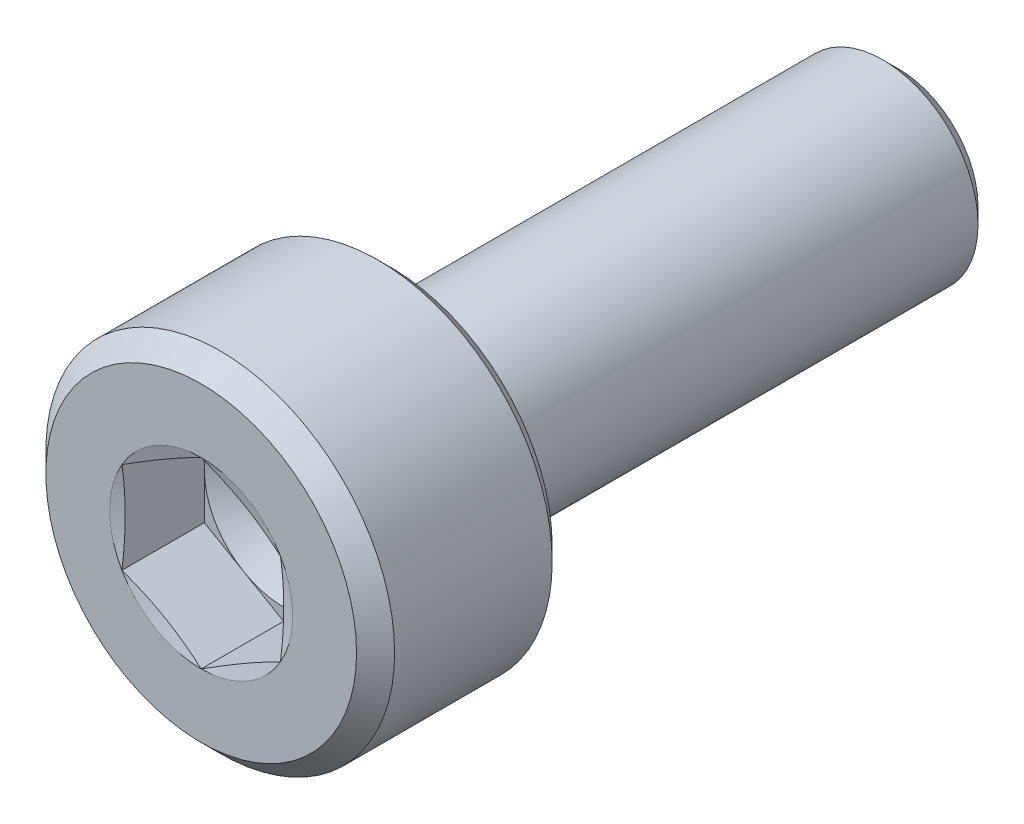
ISO-10303-21;
HEADER;
FILE_DESCRIPTION(('STEP AP214'),'2;1');
FILE_NAME('part.step','',(''),(''),'','','');
FILE_SCHEMA(('AUTOMOTIVE_DESIGN { 1 0 10303 214 1 1 1 1 }'));
ENDSEC;
DATA;
#1=APPLICATION_CONTEXT('core data for automotive mechanical design processes');
#2=APPLICATION_PROTOCOL_DEFINITION('international standard','automotive_design',2000,#1);
#3=PRODUCT_CONTEXT('',#1,'mechanical');
#4=PRODUCT('Part','Part','',(#3));
#5=PRODUCT_RELATED_PRODUCT_CATEGORY('part','',(#4));
#6=PRODUCT_DEFINITION_FORMATION('','',#4);
#7=PRODUCT_DEFINITION_CONTEXT('part definition',#1,'design');
#8=PRODUCT_DEFINITION('design','',#6,#7);
#9=PRODUCT_DEFINITION_SHAPE('','',#8);
#10=(LENGTH_UNIT() NAMED_UNIT(*) SI_UNIT(.MILLI.,.METRE.));
#11=(NAMED_UNIT(*) PLANE_ANGLE_UNIT() SI_UNIT($,.RADIAN.));
#12=(NAMED_UNIT(*) SI_UNIT($,.STERADIAN.) SOLID_ANGLE_UNIT());
#13=UNCERTAINTY_MEASURE_WITH_UNIT(LENGTH_MEASURE(1.E-05),#10,'distance_accuracy_value','');
#14=(GEOMETRIC_REPRESENTATION_CONTEXT(3) GLOBAL_UNCERTAINTY_ASSIGNED_CONTEXT((#13)) GLOBAL_UNIT_ASSIGNED_CONTEXT((#10,
#11,#12)) REPRESENTATION_CONTEXT('',''));
#15=CARTESIAN_POINT('',(0.,0.,0.));
#16=DIRECTION('',(0.,0.,1.));
#17=DIRECTION('',(1.,0.,0.));
#18=AXIS2_PLACEMENT_3D('',#15,#16,#17);
#19=CARTESIAN_POINT('',(0.,0.,0.));
#20=DIRECTION('',(0.,0.,-1.));
#21=DIRECTION('',(-1.,0.,0.));
#22=AXIS2_PLACEMENT_3D('',#19,#20,#21);
#23=PLANE('',#22);
#24=CARTESIAN_POINT('',(0.,0.,0.));
#25=DIRECTION('',(0.,0.,1.));
#26=DIRECTION('',(1.,0.,0.));
#27=AXIS2_PLACEMENT_3D('',#24,#25,#26);
#28=CIRCLE('',#27,2.44999999999999);
#29=CARTESIAN_POINT('',(2.44999999999999,0.,0.));
#30=VERTEX_POINT('',#29);
#31=EDGE_CURVE('E229',#30,#30,#28,.T.);
#32=ORIENTED_EDGE('',*,*,#31,.T.);
#33=EDGE_LOOP('',(#32));
#34=FACE_BOUND('',#33,.T.);
#35=CARTESIAN_POINT('',(0.,0.,0.));
#36=DIRECTION('',(0.,0.,1.));
#37=DIRECTION('',(1.,0.,0.));
#38=AXIS2_PLACEMENT_3D('',#35,#36,#37);
#39=CIRCLE('',#38,1.44337567297407);
#40=CARTESIAN_POINT('',(-1.25,-0.721687836487033,0.));
#41=VERTEX_POINT('',#40);
#42=CARTESIAN_POINT('',(0.,-1.44337567297407,0.));
#43=VERTEX_POINT('',#42);
#44=EDGE_CURVE('E155',#41,#43,#39,.T.);
#45=ORIENTED_EDGE('',*,*,#44,.F.);
#46=CARTESIAN_POINT('',(-1.25,0.721687836487033,0.));
#47=VERTEX_POINT('',#46);
#48=EDGE_CURVE('E154',#47,#41,#39,.T.);
#49=ORIENTED_EDGE('',*,*,#48,.F.);
#50=CARTESIAN_POINT('',(0.,1.44337567297407,0.));
#51=VERTEX_POINT('',#50);
#52=EDGE_CURVE('E121',#51,#47,#39,.T.);
#53=ORIENTED_EDGE('',*,*,#52,.F.);
#54=CARTESIAN_POINT('',(1.25,0.721687836487034,0.));
#55=VERTEX_POINT('',#54);
#56=EDGE_CURVE('E115',#55,#51,#39,.T.);
#57=ORIENTED_EDGE('',*,*,#56,.F.);
#58=CARTESIAN_POINT('',(1.25,-0.721687836487031,0.));
#59=VERTEX_POINT('',#58);
#60=EDGE_CURVE('E123',#59,#55,#39,.T.);
#61=ORIENTED_EDGE('',*,*,#60,.F.);
#62=EDGE_CURVE('E313',#43,#59,#39,.T.);
#63=ORIENTED_EDGE('',*,*,#62,.F.);
#64=EDGE_LOOP('',(#45,#49,#53,#57,#61,#63));
#65=FACE_BOUND('',#64,.T.);
#66=ADVANCED_FACE('F38',(#34,#65),#23,.F.);
#67=CARTESIAN_POINT('',(0.,0.,-0.3));
#68=DIRECTION('',(0.,0.,-1.));
#69=DIRECTION('',(-1.,0.,0.));
#70=AXIS2_PLACEMENT_3D('',#67,#68,#69);
#71=CONICAL_SURFACE('',#70,2.75,0.78539816339746);
#72=ORIENTED_EDGE('',*,*,#31,.F.);
#73=EDGE_LOOP('',(#72));
#74=FACE_BOUND('',#73,.T.);
#75=CARTESIAN_POINT('',(0.,0.,-0.3));
#76=DIRECTION('',(0.,0.,1.));
#77=DIRECTION('',(1.,0.,0.));
#78=AXIS2_PLACEMENT_3D('',#75,#76,#77);
#79=CIRCLE('',#78,2.75);
#80=CARTESIAN_POINT('',(2.75,0.,-0.3));
#81=VERTEX_POINT('',#80);
#82=EDGE_CURVE('E231',#81,#81,#79,.T.);
#83=ORIENTED_EDGE('',*,*,#82,.T.);
#84=EDGE_LOOP('',(#83));
#85=FACE_BOUND('',#84,.T.);
#86=ADVANCED_FACE('F220',(#74,#85),#71,.T.);
#87=CARTESIAN_POINT('',(0.,0.,0.));
#88=DIRECTION('',(0.,0.,1.));
#89=DIRECTION('',(1.,0.,0.));
#90=AXIS2_PLACEMENT_3D('',#87,#88,#89);
#91=CYLINDRICAL_SURFACE('',#90,2.75);
#92=ORIENTED_EDGE('',*,*,#82,.F.);
#93=EDGE_LOOP('',(#92));
#94=FACE_BOUND('',#93,.T.);
#95=CARTESIAN_POINT('',(0.,0.,-2.785));
#96=DIRECTION('',(0.,0.,1.));
#97=DIRECTION('',(1.,0.,0.));
#98=AXIS2_PLACEMENT_3D('',#95,#96,#97);
#99=CIRCLE('',#98,2.75);
#100=CARTESIAN_POINT('',(2.75,0.,-2.785));
#101=VERTEX_POINT('',#100);
#102=EDGE_CURVE('E234',#101,#101,#99,.T.);
#103=ORIENTED_EDGE('',*,*,#102,.T.);
#104=EDGE_LOOP('',(#103));
#105=FACE_BOUND('',#104,.T.);
#106=ADVANCED_FACE('F225',(#94,#105),#91,.T.);
#107=CARTESIAN_POINT('',(0.,0.,-3.));
#108=DIRECTION('',(0.,0.,1.));
#109=DIRECTION('',(1.,0.,0.));
#110=AXIS2_PLACEMENT_3D('',#107,#108,#109);
#111=CONICAL_SURFACE('',#110,2.535,0.785398163397449);
#112=ORIENTED_EDGE('',*,*,#102,.F.);
#113=EDGE_LOOP('',(#112));
#114=FACE_BOUND('',#113,.T.);
#115=CARTESIAN_POINT('',(0.,0.,-3.));
#116=DIRECTION('',(0.,0.,1.));
#117=DIRECTION('',(1.,0.,0.));
#118=AXIS2_PLACEMENT_3D('',#115,#116,#117);
#119=CIRCLE('',#118,2.535);
#120=CARTESIAN_POINT('',(2.535,0.,-3.));
#121=VERTEX_POINT('',#120);
#122=EDGE_CURVE('E239',#121,#121,#119,.T.);
#123=ORIENTED_EDGE('',*,*,#122,.T.);
#124=EDGE_LOOP('',(#123));
#125=FACE_BOUND('',#124,.T.);
#126=ADVANCED_FACE('F429',(#114,#125),#111,.T.);
#127=CARTESIAN_POINT('',(0.,2.535,-3.));
#128=DIRECTION('',(0.,0.,1.));
#129=DIRECTION('',(1.,0.,0.));
#130=AXIS2_PLACEMENT_3D('',#127,#128,#129);
#131=PLANE('',#130);
#132=ORIENTED_EDGE('',*,*,#122,.F.);
#133=EDGE_LOOP('',(#132));
#134=FACE_BOUND('',#133,.T.);
#135=CARTESIAN_POINT('',(0.,0.,-3.));
#136=DIRECTION('',(0.,0.,1.));
#137=DIRECTION('',(1.,0.,0.));
#138=AXIS2_PLACEMENT_3D('',#135,#136,#137);
#139=CIRCLE('',#138,1.8);
#140=CARTESIAN_POINT('',(1.8,0.,-3.));
#141=VERTEX_POINT('',#140);
#142=EDGE_CURVE('E242',#141,#141,#139,.T.);
#143=ORIENTED_EDGE('',*,*,#142,.T.);
#144=EDGE_LOOP('',(#143));
#145=FACE_BOUND('',#144,.T.);
#146=ADVANCED_FACE('F421',(#134,#145),#131,.F.);
#147=CARTESIAN_POINT('',(0.,0.,-3.1));
#148=DIRECTION('',(0.,0.,1.));
#149=DIRECTION('',(1.,0.,0.));
#150=AXIS2_PLACEMENT_3D('',#147,#148,#149);
#151=TOROIDAL_SURFACE('',#150,1.8,0.1);
#152=ORIENTED_EDGE('',*,*,#142,.F.);
#153=EDGE_LOOP('',(#152));
#154=FACE_BOUND('',#153,.T.);
#155=CARTESIAN_POINT('',(0.,0.,-3.05615763679786));
#156=DIRECTION('',(0.,0.,1.));
#157=DIRECTION('',(1.,0.,0.));
#158=AXIS2_PLACEMENT_3D('',#155,#156,#157);
#159=CIRCLE('',#158,1.71012315543561);
#160=CARTESIAN_POINT('',(1.71012315543561,0.,-3.05615763679786));
#161=VERTEX_POINT('',#160);
#162=EDGE_CURVE('E245',#161,#161,#159,.T.);
#163=ORIENTED_EDGE('',*,*,#162,.T.);
#164=EDGE_LOOP('',(#163));
#165=FACE_BOUND('',#164,.T.);
#166=ADVANCED_FACE('F413',(#154,#165),#151,.F.);
#167=CARTESIAN_POINT('',(0.,0.,-3.46615763679786));
#168=DIRECTION('',(0.,0.,1.));
#169=DIRECTION('',(1.,0.,0.));
#170=AXIS2_PLACEMENT_3D('',#167,#168,#169);
#171=CONICAL_SURFACE('',#170,1.51012315543561,0.453844001521511);
#172=ORIENTED_EDGE('',*,*,#162,.F.);
#173=EDGE_LOOP('',(#172));
#174=FACE_BOUND('',#173,.T.);
#175=CARTESIAN_POINT('',(0.,0.,-3.46615763679786));
#176=DIRECTION('',(0.,0.,1.));
#177=DIRECTION('',(1.,0.,0.));
#178=AXIS2_PLACEMENT_3D('',#175,#176,#177);
#179=CIRCLE('',#178,1.51012315543561);
#180=CARTESIAN_POINT('',(1.51012315543561,0.,-3.46615763679786));
#181=VERTEX_POINT('',#180);
#182=EDGE_CURVE('E248',#181,#181,#179,.T.);
#183=ORIENTED_EDGE('',*,*,#182,.T.);
#184=EDGE_LOOP('',(#183));
#185=FACE_BOUND('',#184,.T.);
#186=ADVANCED_FACE('F405',(#174,#185),#171,.T.);
#187=CARTESIAN_POINT('',(0.,0.,-3.51));
#188=DIRECTION('',(0.,0.,1.));
#189=DIRECTION('',(1.,0.,0.));
#190=AXIS2_PLACEMENT_3D('',#187,#188,#189);
#191=TOROIDAL_SURFACE('',#190,1.6,0.1);
#192=ORIENTED_EDGE('',*,*,#182,.F.);
#193=EDGE_LOOP('',(#192));
#194=FACE_BOUND('',#193,.T.);
#195=CARTESIAN_POINT('',(0.,0.,-3.51));
#196=DIRECTION('',(0.,0.,1.));
#197=DIRECTION('',(1.,0.,0.));
#198=AXIS2_PLACEMENT_3D('',#195,#196,#197);
#199=CIRCLE('',#198,1.5);
#200=CARTESIAN_POINT('',(1.5,0.,-3.51));
#201=VERTEX_POINT('',#200);
#202=EDGE_CURVE('E251',#201,#201,#199,.T.);
#203=ORIENTED_EDGE('',*,*,#202,.T.);
#204=EDGE_LOOP('',(#203));
#205=FACE_BOUND('',#204,.T.);
#206=ADVANCED_FACE('F397',(#194,#205),#191,.F.);
#207=CARTESIAN_POINT('',(0.,0.,0.));
#208=DIRECTION('',(0.,0.,1.));
#209=DIRECTION('',(1.,0.,0.));
#210=AXIS2_PLACEMENT_3D('',#207,#208,#209);
#211=CYLINDRICAL_SURFACE('',#210,1.5);
#212=ORIENTED_EDGE('',*,*,#202,.F.);
#213=EDGE_LOOP('',(#212));
#214=FACE_BOUND('',#213,.T.);
#215=CARTESIAN_POINT('',(0.,0.,-10.75));
#216=DIRECTION('',(0.,0.,1.));
#217=DIRECTION('',(1.,0.,0.));
#218=AXIS2_PLACEMENT_3D('',#215,#216,#217);
#219=CIRCLE('',#218,1.5);
#220=CARTESIAN_POINT('',(1.5,0.,-10.75));
#221=VERTEX_POINT('',#220);
#222=EDGE_CURVE('E254',#221,#221,#219,.T.);
#223=ORIENTED_EDGE('',*,*,#222,.T.);
#224=EDGE_LOOP('',(#223));
#225=FACE_BOUND('',#224,.T.);
#226=ADVANCED_FACE('F388',(#214,#225),#211,.T.);
#227=CARTESIAN_POINT('',(0.,0.,-11.));
#228=DIRECTION('',(0.,0.,1.));
#229=DIRECTION('',(1.,0.,0.));
#230=AXIS2_PLACEMENT_3D('',#227,#228,#229);
#231=CONICAL_SURFACE('',#230,1.25,0.785398163397438);
#232=ORIENTED_EDGE('',*,*,#222,.F.);
#233=EDGE_LOOP('',(#232));
#234=FACE_BOUND('',#233,.T.);
#235=CARTESIAN_POINT('',(0.,0.,-11.));
#236=DIRECTION('',(0.,0.,1.));
#237=DIRECTION('',(1.,0.,0.));
#238=AXIS2_PLACEMENT_3D('',#235,#236,#237);
#239=CIRCLE('',#238,1.25);
#240=CARTESIAN_POINT('',(1.25,0.,-11.));
#241=VERTEX_POINT('',#240);
#242=EDGE_CURVE('E257',#241,#241,#239,.T.);
#243=ORIENTED_EDGE('',*,*,#242,.T.);
#244=EDGE_LOOP('',(#243));
#245=FACE_BOUND('',#244,.T.);
#246=ADVANCED_FACE('F380',(#234,#245),#231,.T.);
#247=CARTESIAN_POINT('',(0.,1.25,-11.));
#248=DIRECTION('',(0.,0.,1.));
#249=DIRECTION('',(1.,0.,0.));
#250=AXIS2_PLACEMENT_3D('',#247,#248,#249);
#251=PLANE('',#250);
#252=ORIENTED_EDGE('',*,*,#242,.F.);
#253=EDGE_LOOP('',(#252));
#254=FACE_BOUND('',#253,.T.);
#255=ADVANCED_FACE('F374',(#254),#251,.F.);
#256=CARTESIAN_POINT('',(0.,0.,-0.0518148554092243));
#257=DIRECTION('',(0.,0.,1.));
#258=DIRECTION('',(1.,0.,0.));
#259=AXIS2_PLACEMENT_3D('',#256,#257,#258);
#260=CONICAL_SURFACE('',#259,1.25,1.30899693899575);
#261=ORIENTED_EDGE('',*,*,#52,.T.);
#262=CARTESIAN_POINT('',(-1.2502,0.721572366433195,3.09438201916871E-05));
#263=CARTESIAN_POINT('',(-1.19827409383526,0.751551802335321,-0.00800698378926622));
#264=CARTESIAN_POINT('',(-1.14625401362102,0.781585609650283,-0.0153042105125454));
#265=CARTESIAN_POINT('',(-1.04203006351459,0.841759335300235,-0.0281248924452036));
#266=CARTESIAN_POINT('',(-0.989826127596593,0.871899291755248,-0.0336476265269101));
#267=CARTESIAN_POINT('',(-0.88555111655682,0.932102497448812,-0.0425967858491088));
#268=CARTESIAN_POINT('',(-0.833480747184869,0.962165339222511,-0.0460338877791617));
#269=CARTESIAN_POINT('',(-0.729273575326724,1.0223293779463,-0.0506427032068));
#270=CARTESIAN_POINT('',(-0.677136787663362,1.05243056633842,-0.0518148554092241));
#271=CARTESIAN_POINT('',(-0.572863212336638,1.11263294312267,-0.0518148554092241));
#272=CARTESIAN_POINT('',(-0.520726424673275,1.1427341315148,-0.0506427032068001));
#273=CARTESIAN_POINT('',(-0.416519252815131,1.20289817023859,-0.0460338877791617));
#274=CARTESIAN_POINT('',(-0.36444888344318,1.23296101201229,-0.0425967858491088));
#275=CARTESIAN_POINT('',(-0.260173872403407,1.29316421770585,-0.03364762652691));
#276=CARTESIAN_POINT('',(-0.207969936485411,1.32330417416086,-0.0281248924452036));
#277=CARTESIAN_POINT('',(-0.103745986378985,1.38347789981082,-0.0153042105125453));
#278=CARTESIAN_POINT('',(-0.0517259061647358,1.41351170712578,-0.00800698378926612));
#279=CARTESIAN_POINT('',(0.00020000000000038,1.4434911430279,3.09438201918299E-05));
#280=B_SPLINE_CURVE_WITH_KNOTS('',3,(#262,#263,#264,#265,#266,#267,#268,#269,#270,#271,#272,
#273,#274,#275,#276,#277,#278,#279),.UNSPECIFIED.,.F.,.F.,(4,2,2,2,2,2,2,2,4),(0.,
0.18149525192516,0.363064167833313,0.543695584294992,0.724292010212745,0.9048884361305,
1.08551985259218,1.26708876850033,1.44858402042549),.UNSPECIFIED.);
#281=EDGE_CURVE('E11',#47,#51,#280,.T.);
#282=ORIENTED_EDGE('',*,*,#281,.T.);
#283=EDGE_LOOP('',(#261,#282));
#284=FACE_BOUND('',#283,.T.);
#285=ADVANCED_FACE('F127',(#284),#260,.F.);
#286=CARTESIAN_POINT('',(-1.25,-1.90803764372689,0.224449375411132));
#287=CARTESIAN_POINT('',(-1.25,-1.8513410457493,0.21174373926854));
#288=CARTESIAN_POINT('',(-1.25,-1.79460907964503,0.199195804458375));
#289=CARTESIAN_POINT('',(-1.25,-1.68105673477474,0.174495010900465));
#290=CARTESIAN_POINT('',(-1.25,-1.62423635229394,0.162342169249333));
#291=CARTESIAN_POINT('',(-1.25,-1.4535135757121,0.126574423752231));
#292=CARTESIAN_POINT('',(-1.25,-1.33945900339908,0.103675151182616));
#293=CARTESIAN_POINT('',(-1.25,-1.11170727260793,0.0609587630346281));
#294=CARTESIAN_POINT('',(-1.25,-0.998014548362105,0.0411184667683871));
#295=CARTESIAN_POINT('',(-1.25,-0.769948454688276,0.00583266905587686));
#296=CARTESIAN_POINT('',(-1.25,-0.655575207287998,-0.00961359741797872));
#297=CARTESIAN_POINT('',(-1.25,-0.424787181644499,-0.0341426384914952));
#298=CARTESIAN_POINT('',(-1.25,-0.308363938645654,-0.0431515305449703));
#299=CARTESIAN_POINT('',(-1.25,-0.133499226938177,-0.0502674214127566));
#300=CARTESIAN_POINT('',(-1.25,-0.0751823293286765,-0.0515734559811251));
#301=CARTESIAN_POINT('',(-1.25,0.0414593912908041,-0.0519953132862497));
#302=CARTESIAN_POINT('',(-1.25,0.0997842142946219,-0.0511111377164467));
#303=CARTESIAN_POINT('',(-1.25,0.275064939261687,-0.0452058780708578));
#304=CARTESIAN_POINT('',(-1.25,0.391917619612776,-0.0369155048717787));
#305=CARTESIAN_POINT('',(-1.25,0.624955711707257,-0.013420604100275));
#306=CARTESIAN_POINT('',(-1.25,0.741140574853819,0.00178895996036897));
#307=CARTESIAN_POINT('',(-1.25,0.965009686747211,0.0357098573203466));
#308=CARTESIAN_POINT('',(-1.25,1.07274149713457,0.0541179629895213));
#309=CARTESIAN_POINT('',(-1.25,1.28770836040789,0.0936619087242774));
#310=CARTESIAN_POINT('',(-1.25,1.39494334881407,0.114798093117207));
#311=CARTESIAN_POINT('',(-1.25,1.60905523406172,0.158897571848756));
#312=CARTESIAN_POINT('',(-1.25,1.71593205434096,0.181861233731142));
#313=CARTESIAN_POINT('',(-1.25,1.92941059122614,0.229035853527515));
#314=CARTESIAN_POINT('',(-1.25,2.0360123020935,0.253246837242345));
#315=CARTESIAN_POINT('',(-1.25,2.24796149236902,0.302300913060499));
#316=CARTESIAN_POINT('',(-1.25,2.35331096915779,0.32713541151495));
#317=CARTESIAN_POINT('',(-1.25,2.56386296226419,0.377426560036597));
#318=CARTESIAN_POINT('',(-1.25,2.66906547587909,0.402883221390532));
#319=CARTESIAN_POINT('',(-1.25,2.87922866754162,0.454224569867166));
#320=CARTESIAN_POINT('',(-1.25,2.98418948388924,0.4801086920956));
#321=CARTESIAN_POINT('',(-1.25,3.19401964928918,0.53223064686748));
#322=CARTESIAN_POINT('',(-1.25,3.29888900123911,0.558468467737611));
#323=CARTESIAN_POINT('',(-1.25,3.40372646605654,0.5848316076134));
#324=B_SPLINE_CURVE_WITH_KNOTS('',3,(#286,#287,#288,#289,#290,#291,#292,#293,#294,#295,#296,
#297,#298,#299,#300,#301,#302,#303,#304,#305,#306,#307,#308,#309,#310,#311,#312,#313,#314,#315,
#316,#317,#318,#319,#320,#321,#322,#323),.UNSPECIFIED.,.F.,.F.,(4,2,2,2,2,2,2,2,2,2,2,2,2,2,2,2,
2,2,4),(0.,0.17430798332962,0.348623499364559,0.697591208701206,1.04376859165833,
1.38988566606611,1.73991400543005,1.91487041156219,2.08982668242046,2.44096537417444,
2.79236007022679,3.12019018011378,3.44806170796195,3.77599934506425,4.10394376827983,
4.4286525086615,4.75336714400545,5.07768244044904,5.40198705941089),.UNSPECIFIED.);
#325=EDGE_CURVE('E120',#41,#47,#324,.T.);
#326=ORIENTED_EDGE('',*,*,#325,.T.);
#327=ORIENTED_EDGE('',*,*,#48,.T.);
#328=EDGE_LOOP('',(#326,#327));
#329=FACE_BOUND('',#328,.T.);
#330=ADVANCED_FACE('F361',(#329),#260,.F.);
#331=CARTESIAN_POINT('',(0.000199999999999765,-1.4434911430279,3.09438201913897E-05));
#332=CARTESIAN_POINT('',(-0.0517259061647364,-1.41351170712578,-0.0080069837892665));
#333=CARTESIAN_POINT('',(-0.103745986378985,-1.38347789981081,-0.0153042105125457));
#334=CARTESIAN_POINT('',(-0.207969936485412,-1.32330417416086,-0.028124892445204));
#335=CARTESIAN_POINT('',(-0.260173872403408,-1.29316421770585,-0.0336476265269104));
#336=CARTESIAN_POINT('',(-0.36444888344318,-1.23296101201229,-0.0425967858491091));
#337=CARTESIAN_POINT('',(-0.416519252815131,-1.20289817023859,-0.046033887779162));
#338=CARTESIAN_POINT('',(-0.520726424673276,-1.1427341315148,-0.0506427032068003));
#339=CARTESIAN_POINT('',(-0.572863212336638,-1.11263294312267,-0.0518148554092244));
#340=CARTESIAN_POINT('',(-0.677136787663362,-1.05243056633842,-0.0518148554092244));
#341=CARTESIAN_POINT('',(-0.729273575326725,-1.0223293779463,-0.0506427032068003));
#342=CARTESIAN_POINT('',(-0.833480747184869,-0.962165339222509,-0.046033887779162));
#343=CARTESIAN_POINT('',(-0.88555111655682,-0.93210249744881,-0.0425967858491091));
#344=CARTESIAN_POINT('',(-0.989826127596593,-0.871899291755246,-0.0336476265269103));
#345=CARTESIAN_POINT('',(-1.04203006351459,-0.841759335300233,-0.0281248924452038));
#346=CARTESIAN_POINT('',(-1.14625401362102,-0.781585609650282,-0.0153042105125455));
#347=CARTESIAN_POINT('',(-1.19827409383526,-0.75155180233532,-0.00800698378926632));
#348=CARTESIAN_POINT('',(-1.2502,-0.721572366433194,3.09438201915463E-05));
#349=B_SPLINE_CURVE_WITH_KNOTS('',3,(#331,#332,#333,#334,#335,#336,#337,#338,#339,#340,#341,
#342,#343,#344,#345,#346,#347,#348),.UNSPECIFIED.,.F.,.F.,(4,2,2,2,2,2,2,2,4),(0.,
0.18149525192516,0.363064167833313,0.543695584294991,0.724292010212745,0.904888436130499,
1.08551985259218,1.26708876850033,1.44858402042549),.UNSPECIFIED.);
#350=EDGE_CURVE('E163',#43,#41,#349,.T.);
#351=ORIENTED_EDGE('',*,*,#350,.T.);
#352=ORIENTED_EDGE('',*,*,#44,.T.);
#353=EDGE_LOOP('',(#351,#352));
#354=FACE_BOUND('',#353,.T.);
#355=ADVANCED_FACE('F355',(#354),#260,.F.);
#356=CARTESIAN_POINT('',(1.2502,-0.721572366433195,3.09438201914613E-05));
#357=CARTESIAN_POINT('',(1.19827409383526,-0.75155180233532,-0.00800698378926647));
#358=CARTESIAN_POINT('',(1.14625401362101,-0.781585609650283,-0.0153042105125457));
#359=CARTESIAN_POINT('',(1.04203006351459,-0.841759335300234,-0.0281248924452039));
#360=CARTESIAN_POINT('',(0.989826127596592,-0.871899291755247,-0.0336476265269103));
#361=CARTESIAN_POINT('',(0.88555111655682,-0.932102497448811,-0.042596785849109));
#362=CARTESIAN_POINT('',(0.833480747184869,-0.96216533922251,-0.046033887779162));
#363=CARTESIAN_POINT('',(0.729273575326724,-1.0223293779463,-0.0506427032068003));
#364=CARTESIAN_POINT('',(0.677136787663362,-1.05243056633842,-0.0518148554092244));
#365=CARTESIAN_POINT('',(0.572863212336637,-1.11263294312267,-0.0518148554092244));
#366=CARTESIAN_POINT('',(0.520726424673275,-1.1427341315148,-0.0506427032068003));
#367=CARTESIAN_POINT('',(0.416519252815131,-1.20289817023859,-0.046033887779162));
#368=CARTESIAN_POINT('',(0.36444888344318,-1.23296101201229,-0.042596785849109));
#369=CARTESIAN_POINT('',(0.260173872403407,-1.29316421770585,-0.0336476265269103));
#370=CARTESIAN_POINT('',(0.207969936485411,-1.32330417416086,-0.028124892445204));
#371=CARTESIAN_POINT('',(0.103745986378985,-1.38347789981081,-0.0153042105125458));
#372=CARTESIAN_POINT('',(0.0517259061647362,-1.41351170712578,-0.00800698378926656));
#373=CARTESIAN_POINT('',(-0.000200000000000036,-1.4434911430279,3.09438201914066E-05));
#374=B_SPLINE_CURVE_WITH_KNOTS('',3,(#356,#357,#358,#359,#360,#361,#362,#363,#364,#365,#366,
#367,#368,#369,#370,#371,#372,#373),.UNSPECIFIED.,.F.,.F.,(4,2,2,2,2,2,2,2,4),(0.,
0.18149525192516,0.363064167833312,0.543695584294991,0.724292010212745,0.904888436130499,
1.08551985259218,1.26708876850033,1.44858402042549),.UNSPECIFIED.);
#375=EDGE_CURVE('E183',#59,#43,#374,.T.);
#376=ORIENTED_EDGE('',*,*,#375,.T.);
#377=ORIENTED_EDGE('',*,*,#62,.T.);
#378=EDGE_LOOP('',(#376,#377));
#379=FACE_BOUND('',#378,.T.);
#380=ADVANCED_FACE('F349',(#379),#260,.F.);
#381=CARTESIAN_POINT('',(1.25,-1.90803764372689,0.224449375411132));
#382=CARTESIAN_POINT('',(1.25,-1.8513410457493,0.21174373926854));
#383=CARTESIAN_POINT('',(1.25,-1.79460907964503,0.199195804458375));
#384=CARTESIAN_POINT('',(1.25,-1.68105673477474,0.174495010900465));
#385=CARTESIAN_POINT('',(1.25,-1.62423635229394,0.162342169249333));
#386=CARTESIAN_POINT('',(1.25,-1.4535135757121,0.126574423752231));
#387=CARTESIAN_POINT('',(1.25,-1.33945900339908,0.103675151182616));
#388=CARTESIAN_POINT('',(1.25,-1.11170727260793,0.0609587630346278));
#389=CARTESIAN_POINT('',(1.25,-0.998014548362105,0.0411184667683869));
#390=CARTESIAN_POINT('',(1.25,-0.769948454688276,0.00583266905587672));
#391=CARTESIAN_POINT('',(1.25,-0.655575207287999,-0.00961359741797884));
#392=CARTESIAN_POINT('',(1.25,-0.4247871816445,-0.0341426384914953));
#393=CARTESIAN_POINT('',(1.25,-0.308363938645655,-0.0431515305449704));
#394=CARTESIAN_POINT('',(1.25,-0.133499226938178,-0.0502674214127568));
#395=CARTESIAN_POINT('',(1.25,-0.0751823293286781,-0.0515734559811252));
#396=CARTESIAN_POINT('',(1.25,0.0414593912908024,-0.0519953132862499));
#397=CARTESIAN_POINT('',(1.25,0.0997842142946203,-0.0511111377164469));
#398=CARTESIAN_POINT('',(1.25,0.275064939261685,-0.045205878070858));
#399=CARTESIAN_POINT('',(1.25,0.391917619612775,-0.036915504871779));
#400=CARTESIAN_POINT('',(1.25,0.624955711707256,-0.0134206041002753));
#401=CARTESIAN_POINT('',(1.25,0.741140574853817,0.00178895996036867));
#402=CARTESIAN_POINT('',(1.25,0.96500968674721,0.0357098573203462));
#403=CARTESIAN_POINT('',(1.25,1.07274149713457,0.054117962989521));
#404=CARTESIAN_POINT('',(1.25,1.28770836040789,0.093661908724277));
#405=CARTESIAN_POINT('',(1.25,1.39494334881407,0.114798093117207));
#406=CARTESIAN_POINT('',(1.25,1.60905523406172,0.158897571848756));
#407=CARTESIAN_POINT('',(1.25,1.71593205434096,0.181861233731142));
#408=CARTESIAN_POINT('',(1.25,1.92941059122614,0.229035853527516));
#409=CARTESIAN_POINT('',(1.25,2.0360123020935,0.253246837242345));
#410=CARTESIAN_POINT('',(1.25,2.24796149236902,0.302300913060499));
#411=CARTESIAN_POINT('',(1.25,2.35331096915779,0.32713541151495));
#412=CARTESIAN_POINT('',(1.25,2.56386296226419,0.377426560036597));
#413=CARTESIAN_POINT('',(1.25,2.66906547587909,0.402883221390532));
#414=CARTESIAN_POINT('',(1.25,2.87922866754162,0.454224569867166));
#415=CARTESIAN_POINT('',(1.25,2.98418948388924,0.4801086920956));
#416=CARTESIAN_POINT('',(1.25,3.19401964928918,0.53223064686748));
#417=CARTESIAN_POINT('',(1.25,3.29888900123911,0.558468467737611));
#418=CARTESIAN_POINT('',(1.25,3.40372646605654,0.5848316076134));
#419=B_SPLINE_CURVE_WITH_KNOTS('',3,(#381,#382,#383,#384,#385,#386,#387,#388,#389,#390,#391,
#392,#393,#394,#395,#396,#397,#398,#399,#400,#401,#402,#403,#404,#405,#406,#407,#408,#409,#410,
#411,#412,#413,#414,#415,#416,#417,#418),.UNSPECIFIED.,.F.,.F.,(4,2,2,2,2,2,2,2,2,2,2,2,2,2,2,2,
2,2,4),(0.,0.17430798332962,0.348623499364559,0.697591208701206,1.04376859165833,
1.38988566606611,1.73991400543005,1.91487041156219,2.08982668242046,2.44096537417444,
2.79236007022679,3.12019018011378,3.44806170796195,3.77599934506425,4.10394376827983,
4.4286525086615,4.75336714400545,5.07768244044904,5.40198705941089),.UNSPECIFIED.);
#420=EDGE_CURVE('E63',#55,#59,#419,.F.);
#421=ORIENTED_EDGE('',*,*,#420,.T.);
#422=ORIENTED_EDGE('',*,*,#60,.T.);
#423=EDGE_LOOP('',(#421,#422));
#424=FACE_BOUND('',#423,.T.);
#425=ADVANCED_FACE('F176',(#424),#260,.F.);
#426=CARTESIAN_POINT('',(-0.000199999999999885,1.4434911430279,3.09438201917452E-05));
#427=CARTESIAN_POINT('',(0.0517259061647365,1.41351170712578,-0.00800698378926616));
#428=CARTESIAN_POINT('',(0.103745986378985,1.38347789981081,-0.0153042105125454));
#429=CARTESIAN_POINT('',(0.207969936485411,1.32330417416086,-0.0281248924452036));
#430=CARTESIAN_POINT('',(0.260173872403408,1.29316421770585,-0.03364762652691));
#431=CARTESIAN_POINT('',(0.36444888344318,1.23296101201229,-0.0425967858491087));
#432=CARTESIAN_POINT('',(0.416519252815131,1.20289817023859,-0.0460338877791617));
#433=CARTESIAN_POINT('',(0.520726424673275,1.1427341315148,-0.0506427032068));
#434=CARTESIAN_POINT('',(0.572863212336638,1.11263294312267,-0.0518148554092241));
#435=CARTESIAN_POINT('',(0.677136787663362,1.05243056633842,-0.0518148554092242));
#436=CARTESIAN_POINT('',(0.729273575326724,1.0223293779463,-0.0506427032068001));
#437=CARTESIAN_POINT('',(0.833480747184869,0.962165339222511,-0.0460338877791617));
#438=CARTESIAN_POINT('',(0.88555111655682,0.932102497448812,-0.0425967858491088));
#439=CARTESIAN_POINT('',(0.989826127596592,0.871899291755248,-0.0336476265269101));
#440=CARTESIAN_POINT('',(1.04203006351459,0.841759335300235,-0.0281248924452037));
#441=CARTESIAN_POINT('',(1.14625401362101,0.781585609650283,-0.0153042105125454));
#442=CARTESIAN_POINT('',(1.19827409383526,0.751551802335321,-0.00800698378926624));
#443=CARTESIAN_POINT('',(1.2502,0.721572366433195,3.09438201916591E-05));
#444=B_SPLINE_CURVE_WITH_KNOTS('',3,(#426,#427,#428,#429,#430,#431,#432,#433,#434,#435,#436,
#437,#438,#439,#440,#441,#442,#443),.UNSPECIFIED.,.F.,.F.,(4,2,2,2,2,2,2,2,4),(0.,
0.18149525192516,0.363064167833313,0.543695584294991,0.724292010212745,0.904888436130499,
1.08551985259218,1.26708876850033,1.44858402042549),.UNSPECIFIED.);
#445=EDGE_CURVE('E57',#51,#55,#444,.T.);
#446=ORIENTED_EDGE('',*,*,#445,.T.);
#447=ORIENTED_EDGE('',*,*,#56,.T.);
#448=EDGE_LOOP('',(#446,#447));
#449=FACE_BOUND('',#448,.T.);
#450=ADVANCED_FACE('F116',(#449),#260,.F.);
#451=CARTESIAN_POINT('',(0.,0.,-2.02168783648703));
#452=DIRECTION('',(0.,0.,1.));
#453=DIRECTION('',(1.,0.,0.));
#454=AXIS2_PLACEMENT_3D('',#451,#452,#453);
#455=CONICAL_SURFACE('',#454,0.,1.0471975511966);
#456=CARTESIAN_POINT('',(0.,0.,-1.3));
#457=DIRECTION('',(0.,0.,1.));
#458=DIRECTION('',(1.,0.,0.));
#459=AXIS2_PLACEMENT_3D('',#456,#457,#458);
#460=CIRCLE('',#459,1.25);
#461=CARTESIAN_POINT('',(1.25,0.,-1.3));
#462=VERTEX_POINT('',#461);
#463=CARTESIAN_POINT('',(0.625,1.08253175473055,-1.3));
#464=VERTEX_POINT('',#463);
#465=EDGE_CURVE('E143',#462,#464,#460,.T.);
#466=ORIENTED_EDGE('',*,*,#465,.T.);
#467=CARTESIAN_POINT('',(-0.625,1.08253175473055,-1.3));
#468=VERTEX_POINT('',#467);
#469=EDGE_CURVE('E51',#464,#468,#460,.T.);
#470=ORIENTED_EDGE('',*,*,#469,.T.);
#471=CARTESIAN_POINT('',(-1.25,0.,-1.3));
#472=VERTEX_POINT('',#471);
#473=EDGE_CURVE('E294',#468,#472,#460,.T.);
#474=ORIENTED_EDGE('',*,*,#473,.T.);
#475=CARTESIAN_POINT('',(-0.625,-1.08253175473055,-1.3));
#476=VERTEX_POINT('',#475);
#477=EDGE_CURVE('E296',#472,#476,#460,.T.);
#478=ORIENTED_EDGE('',*,*,#477,.T.);
#479=CARTESIAN_POINT('',(0.624999999999999,-1.08253175473055,-1.3));
#480=VERTEX_POINT('',#479);
#481=EDGE_CURVE('E232',#476,#480,#460,.T.);
#482=ORIENTED_EDGE('',*,*,#481,.T.);
#483=EDGE_CURVE('E230',#480,#462,#460,.T.);
#484=ORIENTED_EDGE('',*,*,#483,.T.);
#485=EDGE_LOOP('',(#466,#470,#474,#478,#482,#484));
#486=FACE_BOUND('',#485,.T.);
#487=CARTESIAN_POINT('',(0.,0.,-2.02168783648703));
#488=VERTEX_POINT('',#487);
#489=VERTEX_LOOP('',#488);
#490=FACE_BOUND('',#489,.T.);
#491=ADVANCED_FACE('F175',(#486,#490),#455,.F.);
#492=CARTESIAN_POINT('',(0.,0.,-1.3));
#493=DIRECTION('',(0.,0.,1.));
#494=DIRECTION('',(1.,0.,0.));
#495=AXIS2_PLACEMENT_3D('',#492,#493,#494);
#496=PLANE('',#495);
#497=ORIENTED_EDGE('',*,*,#465,.F.);
#498=DIRECTION('',(0.,1.,0.));
#499=VECTOR('',#498,1.);
#500=CARTESIAN_POINT('',(1.25,-0.721687836487033,-1.3));
#501=LINE('',#500,#499);
#502=CARTESIAN_POINT('',(1.25,0.721687836487033,-1.3));
#503=VERTEX_POINT('',#502);
#504=EDGE_CURVE('E273',#462,#503,#501,.T.);
#505=ORIENTED_EDGE('',*,*,#504,.T.);
#506=DIRECTION('',(-0.866025403784439,0.5,0.));
#507=VECTOR('',#506,1.);
#508=CARTESIAN_POINT('',(1.25,0.721687836487033,-1.3));
#509=LINE('',#508,#507);
#510=EDGE_CURVE('E288',#503,#464,#509,.T.);
#511=ORIENTED_EDGE('',*,*,#510,.T.);
#512=EDGE_LOOP('',(#497,#505,#511));
#513=FACE_BOUND('',#512,.T.);
#514=ADVANCED_FACE('F318',(#513),#496,.T.);
#515=ORIENTED_EDGE('',*,*,#483,.F.);
#516=DIRECTION('',(0.866025403784439,0.5,0.));
#517=VECTOR('',#516,1.);
#518=CARTESIAN_POINT('',(0.,-1.44337567297406,-1.3));
#519=LINE('',#518,#517);
#520=CARTESIAN_POINT('',(1.25,-0.721687836487033,-1.3));
#521=VERTEX_POINT('',#520);
#522=EDGE_CURVE('E277',#480,#521,#519,.T.);
#523=ORIENTED_EDGE('',*,*,#522,.T.);
#524=EDGE_CURVE('E150',#521,#462,#501,.T.);
#525=ORIENTED_EDGE('',*,*,#524,.T.);
#526=EDGE_LOOP('',(#515,#523,#525));
#527=FACE_BOUND('',#526,.T.);
#528=ADVANCED_FACE('F206',(#527),#496,.T.);
#529=ORIENTED_EDGE('',*,*,#481,.F.);
#530=DIRECTION('',(0.866025403784439,-0.5,0.));
#531=VECTOR('',#530,1.);
#532=CARTESIAN_POINT('',(-1.25,-0.721687836487032,-1.3));
#533=LINE('',#532,#531);
#534=CARTESIAN_POINT('',(0.,-1.44337567297406,-1.3));
#535=VERTEX_POINT('',#534);
#536=EDGE_CURVE('E281',#476,#535,#533,.T.);
#537=ORIENTED_EDGE('',*,*,#536,.T.);
#538=EDGE_CURVE('E274',#535,#480,#519,.T.);
#539=ORIENTED_EDGE('',*,*,#538,.T.);
#540=EDGE_LOOP('',(#529,#537,#539));
#541=FACE_BOUND('',#540,.T.);
#542=ADVANCED_FACE('F309',(#541),#496,.T.);
#543=ORIENTED_EDGE('',*,*,#477,.F.);
#544=DIRECTION('',(0.,-1.,0.));
#545=VECTOR('',#544,1.);
#546=CARTESIAN_POINT('',(-1.25,0.721687836487033,-1.3));
#547=LINE('',#546,#545);
#548=CARTESIAN_POINT('',(-1.25,-0.721687836487032,-1.3));
#549=VERTEX_POINT('',#548);
#550=EDGE_CURVE('E285',#472,#549,#547,.T.);
#551=ORIENTED_EDGE('',*,*,#550,.T.);
#552=EDGE_CURVE('E278',#549,#476,#533,.T.);
#553=ORIENTED_EDGE('',*,*,#552,.T.);
#554=EDGE_LOOP('',(#543,#551,#553));
#555=FACE_BOUND('',#554,.T.);
#556=ADVANCED_FACE('F323',(#555),#496,.T.);
#557=ORIENTED_EDGE('',*,*,#469,.F.);
#558=CARTESIAN_POINT('',(0.,1.44337567297407,-1.3));
#559=VERTEX_POINT('',#558);
#560=EDGE_CURVE('E290',#464,#559,#509,.T.);
#561=ORIENTED_EDGE('',*,*,#560,.T.);
#562=DIRECTION('',(-0.866025403784439,-0.5,0.));
#563=VECTOR('',#562,1.);
#564=CARTESIAN_POINT('',(0.,1.44337567297407,-1.3));
#565=LINE('',#564,#563);
#566=EDGE_CURVE('E148',#559,#468,#565,.T.);
#567=ORIENTED_EDGE('',*,*,#566,.T.);
#568=EDGE_LOOP('',(#557,#561,#567));
#569=FACE_BOUND('',#568,.T.);
#570=ADVANCED_FACE('F320',(#569),#496,.T.);
#571=ORIENTED_EDGE('',*,*,#473,.F.);
#572=CARTESIAN_POINT('',(-1.25,0.721687836487033,-1.3));
#573=VERTEX_POINT('',#572);
#574=EDGE_CURVE('E287',#468,#573,#565,.T.);
#575=ORIENTED_EDGE('',*,*,#574,.T.);
#576=EDGE_CURVE('E282',#573,#472,#547,.T.);
#577=ORIENTED_EDGE('',*,*,#576,.T.);
#578=EDGE_LOOP('',(#571,#575,#577));
#579=FACE_BOUND('',#578,.T.);
#580=ADVANCED_FACE('F322',(#579),#496,.T.);
#581=CARTESIAN_POINT('',(0.,1.44337567297407,-1.3));
#582=DIRECTION('',(-0.5,0.866025403784439,0.));
#583=DIRECTION('',(-0.866025403784439,-0.5,0.));
#584=AXIS2_PLACEMENT_3D('',#581,#582,#583);
#585=PLANE('',#584);
#586=ORIENTED_EDGE('',*,*,#281,.F.);
#587=DIRECTION('',(0.,0.,1.));
#588=VECTOR('',#587,1.);
#589=CARTESIAN_POINT('',(-1.25,0.721687836487033,-1.3));
#590=LINE('',#589,#588);
#591=EDGE_CURVE('E149',#573,#47,#590,.T.);
#592=ORIENTED_EDGE('',*,*,#591,.F.);
#593=ORIENTED_EDGE('',*,*,#574,.F.);
#594=ORIENTED_EDGE('',*,*,#566,.F.);
#595=DIRECTION('',(0.,0.,1.));
#596=VECTOR('',#595,1.);
#597=CARTESIAN_POINT('',(0.,1.44337567297407,-1.3));
#598=LINE('',#597,#596);
#599=EDGE_CURVE('E138',#559,#51,#598,.T.);
#600=ORIENTED_EDGE('',*,*,#599,.T.);
#601=EDGE_LOOP('',(#586,#592,#593,#594,#600));
#602=FACE_BOUND('',#601,.T.);
#603=ADVANCED_FACE('F145',(#602),#585,.F.);
#604=CARTESIAN_POINT('',(-1.25,0.721687836487033,-1.3));
#605=DIRECTION('',(-1.,0.,0.));
#606=DIRECTION('',(0.,0.,1.));
#607=AXIS2_PLACEMENT_3D('',#604,#605,#606);
#608=PLANE('',#607);
#609=ORIENTED_EDGE('',*,*,#325,.F.);
#610=DIRECTION('',(0.,0.,1.));
#611=VECTOR('',#610,1.);
#612=CARTESIAN_POINT('',(-1.25,-0.721687836487032,-1.3));
#613=LINE('',#612,#611);
#614=EDGE_CURVE('E261',#549,#41,#613,.T.);
#615=ORIENTED_EDGE('',*,*,#614,.F.);
#616=ORIENTED_EDGE('',*,*,#550,.F.);
#617=ORIENTED_EDGE('',*,*,#576,.F.);
#618=ORIENTED_EDGE('',*,*,#591,.T.);
#619=EDGE_LOOP('',(#609,#615,#616,#617,#618));
#620=FACE_BOUND('',#619,.T.);
#621=ADVANCED_FACE('F170',(#620),#608,.F.);
#622=CARTESIAN_POINT('',(-1.25,-0.721687836487032,-1.3));
#623=DIRECTION('',(-0.5,-0.866025403784439,0.));
#624=DIRECTION('',(0.866025403784439,-0.5,0.));
#625=AXIS2_PLACEMENT_3D('',#622,#623,#624);
#626=PLANE('',#625);
#627=ORIENTED_EDGE('',*,*,#350,.F.);
#628=DIRECTION('',(0.,0.,1.));
#629=VECTOR('',#628,1.);
#630=CARTESIAN_POINT('',(0.,-1.44337567297406,-1.3));
#631=LINE('',#630,#629);
#632=EDGE_CURVE('E264',#535,#43,#631,.T.);
#633=ORIENTED_EDGE('',*,*,#632,.F.);
#634=ORIENTED_EDGE('',*,*,#536,.F.);
#635=ORIENTED_EDGE('',*,*,#552,.F.);
#636=ORIENTED_EDGE('',*,*,#614,.T.);
#637=EDGE_LOOP('',(#627,#633,#634,#635,#636));
#638=FACE_BOUND('',#637,.T.);
#639=ADVANCED_FACE('F209',(#638),#626,.F.);
#640=CARTESIAN_POINT('',(0.,-1.44337567297406,-1.3));
#641=DIRECTION('',(0.5,-0.866025403784439,0.));
#642=DIRECTION('',(0.866025403784439,0.5,0.));
#643=AXIS2_PLACEMENT_3D('',#640,#641,#642);
#644=PLANE('',#643);
#645=ORIENTED_EDGE('',*,*,#375,.F.);
#646=DIRECTION('',(0.,0.,1.));
#647=VECTOR('',#646,1.);
#648=CARTESIAN_POINT('',(1.25,-0.721687836487033,-1.3));
#649=LINE('',#648,#647);
#650=EDGE_CURVE('E267',#521,#59,#649,.T.);
#651=ORIENTED_EDGE('',*,*,#650,.F.);
#652=ORIENTED_EDGE('',*,*,#522,.F.);
#653=ORIENTED_EDGE('',*,*,#538,.F.);
#654=ORIENTED_EDGE('',*,*,#632,.T.);
#655=EDGE_LOOP('',(#645,#651,#652,#653,#654));
#656=FACE_BOUND('',#655,.T.);
#657=ADVANCED_FACE('F204',(#656),#644,.F.);
#658=CARTESIAN_POINT('',(1.25,-0.721687836487033,-1.3));
#659=DIRECTION('',(1.,0.,0.));
#660=DIRECTION('',(0.,1.,0.));
#661=AXIS2_PLACEMENT_3D('',#658,#659,#660);
#662=PLANE('',#661);
#663=ORIENTED_EDGE('',*,*,#420,.F.);
#664=DIRECTION('',(0.,0.,1.));
#665=VECTOR('',#664,1.);
#666=CARTESIAN_POINT('',(1.25,0.721687836487033,-1.3));
#667=LINE('',#666,#665);
#668=EDGE_CURVE('E142',#503,#55,#667,.T.);
#669=ORIENTED_EDGE('',*,*,#668,.F.);
#670=ORIENTED_EDGE('',*,*,#504,.F.);
#671=ORIENTED_EDGE('',*,*,#524,.F.);
#672=ORIENTED_EDGE('',*,*,#650,.T.);
#673=EDGE_LOOP('',(#663,#669,#670,#671,#672));
#674=FACE_BOUND('',#673,.T.);
#675=ADVANCED_FACE('F201',(#674),#662,.F.);
#676=CARTESIAN_POINT('',(1.25,0.721687836487033,-1.3));
#677=DIRECTION('',(0.5,0.866025403784439,0.));
#678=DIRECTION('',(-0.866025403784439,0.5,0.));
#679=AXIS2_PLACEMENT_3D('',#676,#677,#678);
#680=PLANE('',#679);
#681=ORIENTED_EDGE('',*,*,#445,.F.);
#682=ORIENTED_EDGE('',*,*,#599,.F.);
#683=ORIENTED_EDGE('',*,*,#560,.F.);
#684=ORIENTED_EDGE('',*,*,#510,.F.);
#685=ORIENTED_EDGE('',*,*,#668,.T.);
#686=EDGE_LOOP('',(#681,#682,#683,#684,#685));
#687=FACE_BOUND('',#686,.T.);
#688=ADVANCED_FACE('F136',(#687),#680,.F.);
#689=CLOSED_SHELL('',(#66,#86,#106,#126,#146,#166,#186,#206,#226,#246,#255,#285,#330,#355,#380,
#425,#450,#491,#514,#528,#542,#556,#570,#580,#603,#621,#639,#657,#675,#688));
#690=MANIFOLD_SOLID_BREP('B2',#689);
#691=ADVANCED_BREP_SHAPE_REPRESENTATION('',(#18,#690),#14);
#692=SHAPE_DEFINITION_REPRESENTATION(#9,#691);
ENDSEC;
END-ISO-10303-21;
